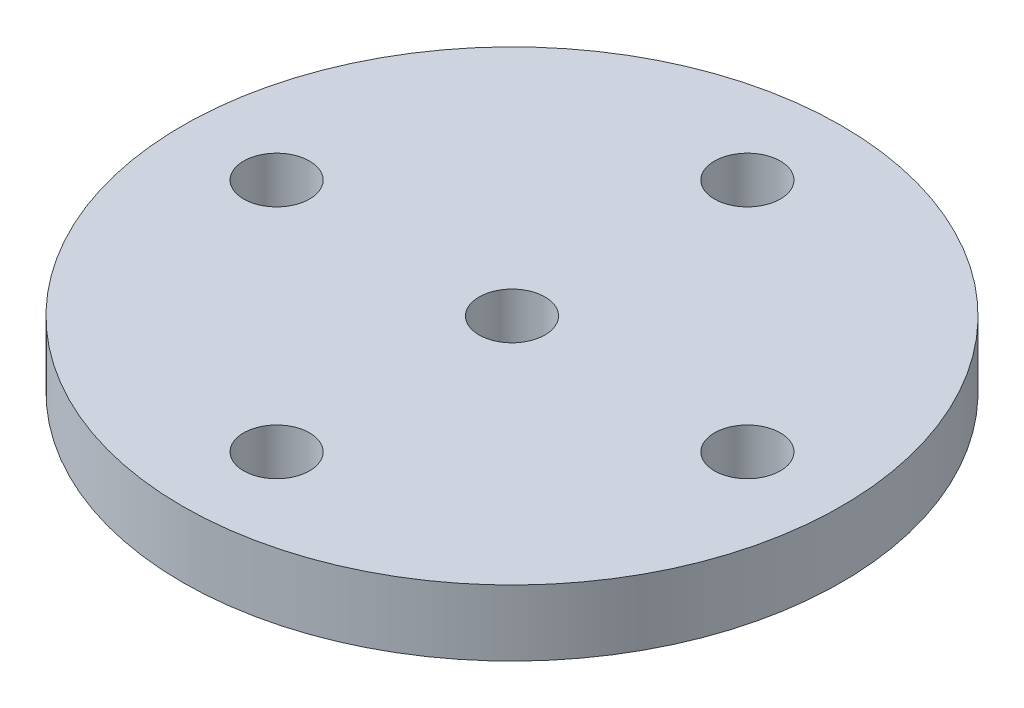
ISO-10303-21;
HEADER;
FILE_DESCRIPTION(('STEP AP214'),'2;1');
FILE_NAME('part.step','',(''),(''),'','','');
FILE_SCHEMA(('AUTOMOTIVE_DESIGN { 1 0 10303 214 1 1 1 1 }'));
ENDSEC;
DATA;
#1=APPLICATION_CONTEXT('core data for automotive mechanical design processes');
#2=APPLICATION_PROTOCOL_DEFINITION('international standard','automotive_design',2000,#1);
#3=PRODUCT_CONTEXT('',#1,'mechanical');
#4=PRODUCT('Part','Part','',(#3));
#5=PRODUCT_RELATED_PRODUCT_CATEGORY('part','',(#4));
#6=PRODUCT_DEFINITION_FORMATION('','',#4);
#7=PRODUCT_DEFINITION_CONTEXT('part definition',#1,'design');
#8=PRODUCT_DEFINITION('design','',#6,#7);
#9=PRODUCT_DEFINITION_SHAPE('','',#8);
#10=(LENGTH_UNIT() NAMED_UNIT(*) SI_UNIT(.MILLI.,.METRE.));
#11=(NAMED_UNIT(*) PLANE_ANGLE_UNIT() SI_UNIT($,.RADIAN.));
#12=(NAMED_UNIT(*) SI_UNIT($,.STERADIAN.) SOLID_ANGLE_UNIT());
#13=UNCERTAINTY_MEASURE_WITH_UNIT(LENGTH_MEASURE(1.E-05),#10,'distance_accuracy_value','');
#14=(GEOMETRIC_REPRESENTATION_CONTEXT(3) GLOBAL_UNCERTAINTY_ASSIGNED_CONTEXT((#13)) GLOBAL_UNIT_ASSIGNED_CONTEXT((#10,
#11,#12)) REPRESENTATION_CONTEXT('',''));
#15=CARTESIAN_POINT('',(0.,0.,0.));
#16=DIRECTION('',(0.,0.,1.));
#17=DIRECTION('',(1.,0.,0.));
#18=AXIS2_PLACEMENT_3D('',#15,#16,#17);
#19=CARTESIAN_POINT('',(0.,3.5,0.));
#20=DIRECTION('',(0.,-1.,0.));
#21=DIRECTION('',(0.,0.,-1.));
#22=AXIS2_PLACEMENT_3D('',#19,#20,#21);
#23=CYLINDRICAL_SURFACE('',#22,17.5);
#24=CARTESIAN_POINT('',(0.,3.5,0.));
#25=DIRECTION('',(0.,1.,0.));
#26=DIRECTION('',(0.,0.,1.));
#27=AXIS2_PLACEMENT_3D('',#24,#25,#26);
#28=CIRCLE('',#27,17.5);
#29=CARTESIAN_POINT('',(0.,3.5,17.5));
#30=VERTEX_POINT('',#29);
#31=EDGE_CURVE('E10',#30,#30,#28,.T.);
#32=ORIENTED_EDGE('',*,*,#31,.F.);
#33=EDGE_LOOP('',(#32));
#34=FACE_BOUND('',#33,.T.);
#35=CARTESIAN_POINT('',(0.,0.,0.));
#36=DIRECTION('',(0.,1.,0.));
#37=DIRECTION('',(0.,0.,1.));
#38=AXIS2_PLACEMENT_3D('',#35,#36,#37);
#39=CIRCLE('',#38,17.5);
#40=CARTESIAN_POINT('',(0.,0.,17.5));
#41=VERTEX_POINT('',#40);
#42=EDGE_CURVE('E39',#41,#41,#39,.T.);
#43=ORIENTED_EDGE('',*,*,#42,.T.);
#44=EDGE_LOOP('',(#43));
#45=FACE_BOUND('',#44,.T.);
#46=ADVANCED_FACE('F36',(#34,#45),#23,.T.);
#47=CARTESIAN_POINT('',(0.,3.5,0.));
#48=DIRECTION('',(0.,1.,0.));
#49=DIRECTION('',(0.,0.,1.));
#50=AXIS2_PLACEMENT_3D('',#47,#48,#49);
#51=PLANE('',#50);
#52=CARTESIAN_POINT('',(-12.5,3.5,0.));
#53=DIRECTION('',(0.,1.,0.));
#54=DIRECTION('',(0.,0.,1.));
#55=AXIS2_PLACEMENT_3D('',#52,#53,#54);
#56=CIRCLE('',#55,1.75);
#57=CARTESIAN_POINT('',(-12.5,3.5,1.75));
#58=VERTEX_POINT('',#57);
#59=EDGE_CURVE('E46',#58,#58,#56,.T.);
#60=ORIENTED_EDGE('',*,*,#59,.F.);
#61=EDGE_LOOP('',(#60));
#62=FACE_BOUND('',#61,.T.);
#63=CARTESIAN_POINT('',(0.,3.5,12.5));
#64=DIRECTION('',(0.,1.,0.));
#65=DIRECTION('',(0.,0.,1.));
#66=AXIS2_PLACEMENT_3D('',#63,#64,#65);
#67=CIRCLE('',#66,1.75);
#68=CARTESIAN_POINT('',(0.,3.5,14.25));
#69=VERTEX_POINT('',#68);
#70=EDGE_CURVE('E66',#69,#69,#67,.T.);
#71=ORIENTED_EDGE('',*,*,#70,.F.);
#72=EDGE_LOOP('',(#71));
#73=FACE_BOUND('',#72,.T.);
#74=CARTESIAN_POINT('',(0.,3.5,0.));
#75=DIRECTION('',(0.,1.,0.));
#76=DIRECTION('',(0.,0.,1.));
#77=AXIS2_PLACEMENT_3D('',#74,#75,#76);
#78=CIRCLE('',#77,1.75);
#79=CARTESIAN_POINT('',(0.,3.5,1.75));
#80=VERTEX_POINT('',#79);
#81=EDGE_CURVE('E65',#80,#80,#78,.T.);
#82=ORIENTED_EDGE('',*,*,#81,.F.);
#83=EDGE_LOOP('',(#82));
#84=FACE_BOUND('',#83,.T.);
#85=CARTESIAN_POINT('',(12.5,3.5,0.));
#86=DIRECTION('',(0.,1.,0.));
#87=DIRECTION('',(0.,0.,1.));
#88=AXIS2_PLACEMENT_3D('',#85,#86,#87);
#89=CIRCLE('',#88,1.75);
#90=CARTESIAN_POINT('',(12.5,3.5,1.75));
#91=VERTEX_POINT('',#90);
#92=EDGE_CURVE('E52',#91,#91,#89,.T.);
#93=ORIENTED_EDGE('',*,*,#92,.F.);
#94=EDGE_LOOP('',(#93));
#95=FACE_BOUND('',#94,.T.);
#96=CARTESIAN_POINT('',(0.,3.5,-12.5));
#97=DIRECTION('',(0.,1.,0.));
#98=DIRECTION('',(0.,0.,1.));
#99=AXIS2_PLACEMENT_3D('',#96,#97,#98);
#100=CIRCLE('',#99,1.75);
#101=CARTESIAN_POINT('',(0.,3.5,-10.75));
#102=VERTEX_POINT('',#101);
#103=EDGE_CURVE('E51',#102,#102,#100,.T.);
#104=ORIENTED_EDGE('',*,*,#103,.F.);
#105=EDGE_LOOP('',(#104));
#106=FACE_BOUND('',#105,.T.);
#107=ORIENTED_EDGE('',*,*,#31,.T.);
#108=EDGE_LOOP('',(#107));
#109=FACE_BOUND('',#108,.T.);
#110=ADVANCED_FACE('F88',(#62,#73,#84,#95,#106,#109),#51,.T.);
#111=CARTESIAN_POINT('',(0.,0.,0.));
#112=DIRECTION('',(0.,1.,0.));
#113=DIRECTION('',(0.,0.,1.));
#114=AXIS2_PLACEMENT_3D('',#111,#112,#113);
#115=PLANE('',#114);
#116=CARTESIAN_POINT('',(-12.5,0.,0.));
#117=DIRECTION('',(0.,1.,0.));
#118=DIRECTION('',(0.,0.,1.));
#119=AXIS2_PLACEMENT_3D('',#116,#117,#118);
#120=CIRCLE('',#119,1.75);
#121=CARTESIAN_POINT('',(-12.5,0.,1.75));
#122=VERTEX_POINT('',#121);
#123=EDGE_CURVE('E59',#122,#122,#120,.T.);
#124=ORIENTED_EDGE('',*,*,#123,.T.);
#125=EDGE_LOOP('',(#124));
#126=FACE_BOUND('',#125,.T.);
#127=CARTESIAN_POINT('',(0.,0.,12.5));
#128=DIRECTION('',(0.,1.,0.));
#129=DIRECTION('',(0.,0.,1.));
#130=AXIS2_PLACEMENT_3D('',#127,#128,#129);
#131=CIRCLE('',#130,1.75);
#132=CARTESIAN_POINT('',(0.,0.,14.25));
#133=VERTEX_POINT('',#132);
#134=EDGE_CURVE('E62',#133,#133,#131,.T.);
#135=ORIENTED_EDGE('',*,*,#134,.T.);
#136=EDGE_LOOP('',(#135));
#137=FACE_BOUND('',#136,.T.);
#138=CARTESIAN_POINT('',(0.,0.,0.));
#139=DIRECTION('',(0.,1.,0.));
#140=DIRECTION('',(0.,0.,1.));
#141=AXIS2_PLACEMENT_3D('',#138,#139,#140);
#142=CIRCLE('',#141,1.75);
#143=CARTESIAN_POINT('',(0.,0.,1.75));
#144=VERTEX_POINT('',#143);
#145=EDGE_CURVE('E55',#144,#144,#142,.T.);
#146=ORIENTED_EDGE('',*,*,#145,.T.);
#147=EDGE_LOOP('',(#146));
#148=FACE_BOUND('',#147,.T.);
#149=CARTESIAN_POINT('',(12.5,0.,0.));
#150=DIRECTION('',(0.,1.,0.));
#151=DIRECTION('',(0.,0.,1.));
#152=AXIS2_PLACEMENT_3D('',#149,#150,#151);
#153=CIRCLE('',#152,1.75);
#154=CARTESIAN_POINT('',(12.5,0.,1.75));
#155=VERTEX_POINT('',#154);
#156=EDGE_CURVE('E48',#155,#155,#153,.T.);
#157=ORIENTED_EDGE('',*,*,#156,.T.);
#158=EDGE_LOOP('',(#157));
#159=FACE_BOUND('',#158,.T.);
#160=CARTESIAN_POINT('',(0.,0.,-12.5));
#161=DIRECTION('',(0.,1.,0.));
#162=DIRECTION('',(0.,0.,1.));
#163=AXIS2_PLACEMENT_3D('',#160,#161,#162);
#164=CIRCLE('',#163,1.75);
#165=CARTESIAN_POINT('',(0.,0.,-10.75));
#166=VERTEX_POINT('',#165);
#167=EDGE_CURVE('E56',#166,#166,#164,.T.);
#168=ORIENTED_EDGE('',*,*,#167,.T.);
#169=EDGE_LOOP('',(#168));
#170=FACE_BOUND('',#169,.T.);
#171=ORIENTED_EDGE('',*,*,#42,.F.);
#172=EDGE_LOOP('',(#171));
#173=FACE_BOUND('',#172,.T.);
#174=ADVANCED_FACE('F78',(#126,#137,#148,#159,#170,#173),#115,.F.);
#175=CARTESIAN_POINT('',(0.,8.44974746830584,-12.5));
#176=DIRECTION('',(0.,-1.,0.));
#177=DIRECTION('',(0.,0.,-1.));
#178=AXIS2_PLACEMENT_3D('',#175,#176,#177);
#179=CYLINDRICAL_SURFACE('',#178,1.75);
#180=ORIENTED_EDGE('',*,*,#167,.F.);
#181=EDGE_LOOP('',(#180));
#182=FACE_BOUND('',#181,.T.);
#183=ORIENTED_EDGE('',*,*,#103,.T.);
#184=EDGE_LOOP('',(#183));
#185=FACE_BOUND('',#184,.T.);
#186=ADVANCED_FACE('F100',(#182,#185),#179,.F.);
#187=CARTESIAN_POINT('',(12.5,8.44974746830584,0.));
#188=DIRECTION('',(0.,-1.,0.));
#189=DIRECTION('',(0.,0.,-1.));
#190=AXIS2_PLACEMENT_3D('',#187,#188,#189);
#191=CYLINDRICAL_SURFACE('',#190,1.75);
#192=ORIENTED_EDGE('',*,*,#156,.F.);
#193=EDGE_LOOP('',(#192));
#194=FACE_BOUND('',#193,.T.);
#195=ORIENTED_EDGE('',*,*,#92,.T.);
#196=EDGE_LOOP('',(#195));
#197=FACE_BOUND('',#196,.T.);
#198=ADVANCED_FACE('F102',(#194,#197),#191,.F.);
#199=CARTESIAN_POINT('',(0.,8.44974746830584,0.));
#200=DIRECTION('',(0.,-1.,0.));
#201=DIRECTION('',(0.,0.,-1.));
#202=AXIS2_PLACEMENT_3D('',#199,#200,#201);
#203=CYLINDRICAL_SURFACE('',#202,1.75);
#204=ORIENTED_EDGE('',*,*,#145,.F.);
#205=EDGE_LOOP('',(#204));
#206=FACE_BOUND('',#205,.T.);
#207=ORIENTED_EDGE('',*,*,#81,.T.);
#208=EDGE_LOOP('',(#207));
#209=FACE_BOUND('',#208,.T.);
#210=ADVANCED_FACE('F109',(#206,#209),#203,.F.);
#211=CARTESIAN_POINT('',(0.,8.44974746830584,12.5));
#212=DIRECTION('',(0.,-1.,0.));
#213=DIRECTION('',(0.,0.,-1.));
#214=AXIS2_PLACEMENT_3D('',#211,#212,#213);
#215=CYLINDRICAL_SURFACE('',#214,1.75);
#216=ORIENTED_EDGE('',*,*,#134,.F.);
#217=EDGE_LOOP('',(#216));
#218=FACE_BOUND('',#217,.T.);
#219=ORIENTED_EDGE('',*,*,#70,.T.);
#220=EDGE_LOOP('',(#219));
#221=FACE_BOUND('',#220,.T.);
#222=ADVANCED_FACE('F84',(#218,#221),#215,.F.);
#223=CARTESIAN_POINT('',(-12.5,8.44974746830584,0.));
#224=DIRECTION('',(0.,-1.,0.));
#225=DIRECTION('',(0.,0.,-1.));
#226=AXIS2_PLACEMENT_3D('',#223,#224,#225);
#227=CYLINDRICAL_SURFACE('',#226,1.75);
#228=ORIENTED_EDGE('',*,*,#123,.F.);
#229=EDGE_LOOP('',(#228));
#230=FACE_BOUND('',#229,.T.);
#231=ORIENTED_EDGE('',*,*,#59,.T.);
#232=EDGE_LOOP('',(#231));
#233=FACE_BOUND('',#232,.T.);
#234=ADVANCED_FACE('F81',(#230,#233),#227,.F.);
#235=CLOSED_SHELL('',(#46,#110,#174,#186,#198,#210,#222,#234));
#236=MANIFOLD_SOLID_BREP('B2',#235);
#237=ADVANCED_BREP_SHAPE_REPRESENTATION('',(#18,#236),#14);
#238=SHAPE_DEFINITION_REPRESENTATION(#9,#237);
ENDSEC;
END-ISO-10303-21;
